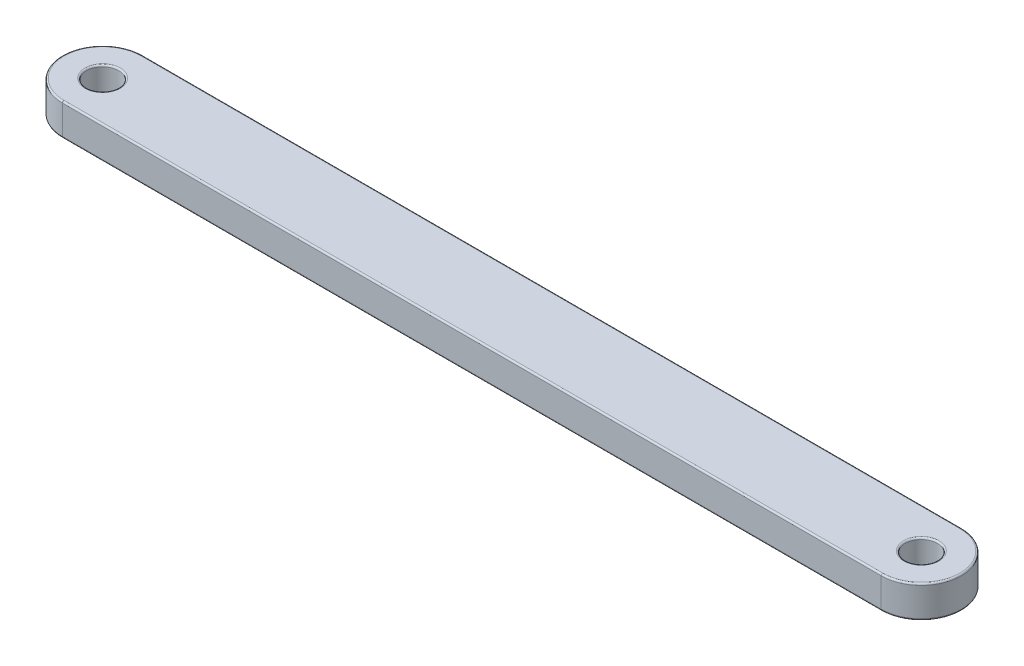
ISO-10303-21;
HEADER;
FILE_DESCRIPTION(('STEP AP214'),'2;1');
FILE_NAME('part.step','',(''),(''),'','','');
FILE_SCHEMA(('AUTOMOTIVE_DESIGN { 1 0 10303 214 1 1 1 1 }'));
ENDSEC;
DATA;
#1=APPLICATION_CONTEXT('core data for automotive mechanical design processes');
#2=APPLICATION_PROTOCOL_DEFINITION('international standard','automotive_design',2000,#1);
#3=PRODUCT_CONTEXT('',#1,'mechanical');
#4=PRODUCT('Part','Part','',(#3));
#5=PRODUCT_RELATED_PRODUCT_CATEGORY('part','',(#4));
#6=PRODUCT_DEFINITION_FORMATION('','',#4);
#7=PRODUCT_DEFINITION_CONTEXT('part definition',#1,'design');
#8=PRODUCT_DEFINITION('design','',#6,#7);
#9=PRODUCT_DEFINITION_SHAPE('','',#8);
#10=(LENGTH_UNIT() NAMED_UNIT(*) SI_UNIT(.MILLI.,.METRE.));
#11=(NAMED_UNIT(*) PLANE_ANGLE_UNIT() SI_UNIT($,.RADIAN.));
#12=(NAMED_UNIT(*) SI_UNIT($,.STERADIAN.) SOLID_ANGLE_UNIT());
#13=UNCERTAINTY_MEASURE_WITH_UNIT(LENGTH_MEASURE(1.E-05),#10,'distance_accuracy_value','');
#14=(GEOMETRIC_REPRESENTATION_CONTEXT(3) GLOBAL_UNCERTAINTY_ASSIGNED_CONTEXT((#13)) GLOBAL_UNIT_ASSIGNED_CONTEXT((#10,
#11,#12)) REPRESENTATION_CONTEXT('',''));
#15=CARTESIAN_POINT('',(0.,0.,0.));
#16=DIRECTION('',(0.,0.,1.));
#17=DIRECTION('',(1.,0.,0.));
#18=AXIS2_PLACEMENT_3D('',#15,#16,#17);
#19=CARTESIAN_POINT('',(-31.875,11.25,0.));
#20=DIRECTION('',(0.,1.,0.));
#21=DIRECTION('',(0.,0.,1.));
#22=AXIS2_PLACEMENT_3D('',#19,#20,#21);
#23=PLANE('',#22);
#24=CARTESIAN_POINT('',(31.875,11.25,0.));
#25=DIRECTION('',(0.,1.,0.));
#26=DIRECTION('',(0.,0.,1.));
#27=AXIS2_PLACEMENT_3D('',#24,#25,#26);
#28=CIRCLE('',#27,1.375);
#29=CARTESIAN_POINT('',(31.875,11.25,1.37499999999996));
#30=VERTEX_POINT('',#29);
#31=EDGE_CURVE('E11',#30,#30,#28,.F.);
#32=ORIENTED_EDGE('',*,*,#31,.T.);
#33=EDGE_LOOP('',(#32));
#34=FACE_BOUND('',#33,.T.);
#35=CARTESIAN_POINT('',(31.875,11.25,0.));
#36=DIRECTION('',(0.,1.,0.));
#37=DIRECTION('',(0.,0.,1.));
#38=AXIS2_PLACEMENT_3D('',#35,#36,#37);
#39=CIRCLE('',#38,3.);
#40=CARTESIAN_POINT('',(31.875,11.25,2.99999999999995));
#41=VERTEX_POINT('',#40);
#42=CARTESIAN_POINT('',(31.875,11.25,-3.00000000000005));
#43=VERTEX_POINT('',#42);
#44=EDGE_CURVE('E53',#41,#43,#39,.T.);
#45=ORIENTED_EDGE('',*,*,#44,.T.);
#46=DIRECTION('',(-1.,0.,0.));
#47=VECTOR('',#46,1.);
#48=CARTESIAN_POINT('',(-31.875,11.25,-3.00000000000004));
#49=LINE('',#48,#47);
#50=CARTESIAN_POINT('',(-31.875,11.25,-3.00000000000004));
#51=VERTEX_POINT('',#50);
#52=EDGE_CURVE('E45',#43,#51,#49,.T.);
#53=ORIENTED_EDGE('',*,*,#52,.T.);
#54=CARTESIAN_POINT('',(-31.875,11.25,0.));
#55=DIRECTION('',(0.,1.,0.));
#56=DIRECTION('',(0.,0.,1.));
#57=AXIS2_PLACEMENT_3D('',#54,#55,#56);
#58=CIRCLE('',#57,3.);
#59=CARTESIAN_POINT('',(-31.875,11.25,2.99999999999996));
#60=VERTEX_POINT('',#59);
#61=EDGE_CURVE('E171',#51,#60,#58,.T.);
#62=ORIENTED_EDGE('',*,*,#61,.T.);
#63=DIRECTION('',(1.,0.,0.));
#64=VECTOR('',#63,1.);
#65=CARTESIAN_POINT('',(31.875,11.25,2.99999999999995));
#66=LINE('',#65,#64);
#67=EDGE_CURVE('E58',#60,#41,#66,.T.);
#68=ORIENTED_EDGE('',*,*,#67,.T.);
#69=EDGE_LOOP('',(#45,#53,#62,#68));
#70=FACE_BOUND('',#69,.T.);
#71=CARTESIAN_POINT('',(-31.875,11.25,0.));
#72=DIRECTION('',(0.,1.,0.));
#73=DIRECTION('',(0.,0.,1.));
#74=AXIS2_PLACEMENT_3D('',#71,#72,#73);
#75=CIRCLE('',#74,1.375);
#76=CARTESIAN_POINT('',(-31.875,11.25,1.37499999999996));
#77=VERTEX_POINT('',#76);
#78=EDGE_CURVE('E168',#77,#77,#75,.F.);
#79=ORIENTED_EDGE('',*,*,#78,.T.);
#80=EDGE_LOOP('',(#79));
#81=FACE_BOUND('',#80,.T.);
#82=ADVANCED_FACE('F36',(#34,#70,#81),#23,.T.);
#83=CARTESIAN_POINT('',(-31.875,8.75,0.));
#84=DIRECTION('',(0.,1.,0.));
#85=DIRECTION('',(0.,0.,1.));
#86=AXIS2_PLACEMENT_3D('',#83,#84,#85);
#87=PLANE('',#86);
#88=CARTESIAN_POINT('',(31.875,8.75,0.));
#89=DIRECTION('',(0.,1.,0.));
#90=DIRECTION('',(0.,0.,1.));
#91=AXIS2_PLACEMENT_3D('',#88,#89,#90);
#92=CIRCLE('',#91,1.375);
#93=CARTESIAN_POINT('',(31.875,8.75,1.37499999999996));
#94=VERTEX_POINT('',#93);
#95=EDGE_CURVE('E133',#94,#94,#92,.T.);
#96=ORIENTED_EDGE('',*,*,#95,.T.);
#97=EDGE_LOOP('',(#96));
#98=FACE_BOUND('',#97,.T.);
#99=CARTESIAN_POINT('',(-31.875,8.75,0.));
#100=DIRECTION('',(0.,1.,0.));
#101=DIRECTION('',(0.,0.,1.));
#102=AXIS2_PLACEMENT_3D('',#99,#100,#101);
#103=CIRCLE('',#102,1.375);
#104=CARTESIAN_POINT('',(-31.875,8.75,1.37499999999996));
#105=VERTEX_POINT('',#104);
#106=EDGE_CURVE('E130',#105,#105,#103,.T.);
#107=ORIENTED_EDGE('',*,*,#106,.T.);
#108=EDGE_LOOP('',(#107));
#109=FACE_BOUND('',#108,.T.);
#110=CARTESIAN_POINT('',(31.875,8.75,0.));
#111=DIRECTION('',(0.,1.,0.));
#112=DIRECTION('',(0.,0.,1.));
#113=AXIS2_PLACEMENT_3D('',#110,#111,#112);
#114=CIRCLE('',#113,3.);
#115=CARTESIAN_POINT('',(31.875,8.75,-3.00000000000005));
#116=VERTEX_POINT('',#115);
#117=CARTESIAN_POINT('',(31.875,8.75,2.99999999999995));
#118=VERTEX_POINT('',#117);
#119=EDGE_CURVE('E129',#116,#118,#114,.F.);
#120=ORIENTED_EDGE('',*,*,#119,.T.);
#121=DIRECTION('',(1.,0.,0.));
#122=VECTOR('',#121,1.);
#123=CARTESIAN_POINT('',(-31.875,8.75,2.99999999999996));
#124=LINE('',#123,#122);
#125=CARTESIAN_POINT('',(-31.875,8.75,2.99999999999996));
#126=VERTEX_POINT('',#125);
#127=EDGE_CURVE('E108',#118,#126,#124,.F.);
#128=ORIENTED_EDGE('',*,*,#127,.T.);
#129=CARTESIAN_POINT('',(-31.875,8.75,0.));
#130=DIRECTION('',(0.,1.,0.));
#131=DIRECTION('',(0.,0.,1.));
#132=AXIS2_PLACEMENT_3D('',#129,#130,#131);
#133=CIRCLE('',#132,3.);
#134=CARTESIAN_POINT('',(-31.875,8.75,-3.00000000000004));
#135=VERTEX_POINT('',#134);
#136=EDGE_CURVE('E118',#126,#135,#133,.F.);
#137=ORIENTED_EDGE('',*,*,#136,.T.);
#138=DIRECTION('',(-1.,0.,0.));
#139=VECTOR('',#138,1.);
#140=CARTESIAN_POINT('',(-31.875,8.75,-3.00000000000004));
#141=LINE('',#140,#139);
#142=EDGE_CURVE('E124',#135,#116,#141,.F.);
#143=ORIENTED_EDGE('',*,*,#142,.T.);
#144=EDGE_LOOP('',(#120,#128,#137,#143));
#145=FACE_BOUND('',#144,.T.);
#146=ADVANCED_FACE('F127',(#98,#109,#145),#87,.F.);
#147=CARTESIAN_POINT('',(-31.875,11.25,0.));
#148=DIRECTION('',(0.,-1.,0.));
#149=DIRECTION('',(0.,0.,-1.));
#150=AXIS2_PLACEMENT_3D('',#147,#148,#149);
#151=CYLINDRICAL_SURFACE('',#150,3.125);
#152=DIRECTION('',(0.,-1.,0.));
#153=VECTOR('',#152,1.);
#154=CARTESIAN_POINT('',(-31.875,11.25,-3.12500000000004));
#155=LINE('',#154,#153);
#156=CARTESIAN_POINT('',(-31.875,11.125,-3.12500000000004));
#157=VERTEX_POINT('',#156);
#158=CARTESIAN_POINT('',(-31.875,8.875,-3.12500000000004));
#159=VERTEX_POINT('',#158);
#160=EDGE_CURVE('E180',#157,#159,#155,.T.);
#161=ORIENTED_EDGE('',*,*,#160,.T.);
#162=CARTESIAN_POINT('',(-31.875,8.875,0.));
#163=DIRECTION('',(0.,1.,0.));
#164=DIRECTION('',(0.,0.,1.));
#165=AXIS2_PLACEMENT_3D('',#162,#163,#164);
#166=CIRCLE('',#165,3.125);
#167=CARTESIAN_POINT('',(-31.875,8.875,3.12499999999996));
#168=VERTEX_POINT('',#167);
#169=EDGE_CURVE('E166',#159,#168,#166,.T.);
#170=ORIENTED_EDGE('',*,*,#169,.T.);
#171=DIRECTION('',(0.,-1.,0.));
#172=VECTOR('',#171,1.);
#173=CARTESIAN_POINT('',(-31.875,11.25,3.12499999999996));
#174=LINE('',#173,#172);
#175=CARTESIAN_POINT('',(-31.875,11.125,3.12499999999996));
#176=VERTEX_POINT('',#175);
#177=EDGE_CURVE('E125',#176,#168,#174,.T.);
#178=ORIENTED_EDGE('',*,*,#177,.F.);
#179=CARTESIAN_POINT('',(-31.875,11.125,0.));
#180=DIRECTION('',(0.,1.,0.));
#181=DIRECTION('',(0.,0.,1.));
#182=AXIS2_PLACEMENT_3D('',#179,#180,#181);
#183=CIRCLE('',#182,3.125);
#184=EDGE_CURVE('E164',#176,#157,#183,.F.);
#185=ORIENTED_EDGE('',*,*,#184,.T.);
#186=EDGE_LOOP('',(#161,#170,#178,#185));
#187=FACE_BOUND('',#186,.T.);
#188=ADVANCED_FACE('F206',(#187),#151,.T.);
#189=CARTESIAN_POINT('',(-31.875,11.25,3.12499999999996));
#190=DIRECTION('',(0.,0.,-1.));
#191=DIRECTION('',(-1.,0.,0.));
#192=AXIS2_PLACEMENT_3D('',#189,#190,#191);
#193=PLANE('',#192);
#194=ORIENTED_EDGE('',*,*,#177,.T.);
#195=DIRECTION('',(1.,0.,0.));
#196=VECTOR('',#195,1.);
#197=CARTESIAN_POINT('',(-31.875,8.875,3.12499999999996));
#198=LINE('',#197,#196);
#199=CARTESIAN_POINT('',(31.875,8.875,3.12499999999995));
#200=VERTEX_POINT('',#199);
#201=EDGE_CURVE('E111',#168,#200,#198,.T.);
#202=ORIENTED_EDGE('',*,*,#201,.T.);
#203=DIRECTION('',(0.,-1.,0.));
#204=VECTOR('',#203,1.);
#205=CARTESIAN_POINT('',(31.875,11.25,3.12499999999995));
#206=LINE('',#205,#204);
#207=CARTESIAN_POINT('',(31.875,11.125,3.12499999999995));
#208=VERTEX_POINT('',#207);
#209=EDGE_CURVE('E203',#208,#200,#206,.T.);
#210=ORIENTED_EDGE('',*,*,#209,.F.);
#211=DIRECTION('',(1.,0.,0.));
#212=VECTOR('',#211,1.);
#213=CARTESIAN_POINT('',(-31.875,11.125,3.12499999999996));
#214=LINE('',#213,#212);
#215=EDGE_CURVE('E152',#208,#176,#214,.F.);
#216=ORIENTED_EDGE('',*,*,#215,.T.);
#217=EDGE_LOOP('',(#194,#202,#210,#216));
#218=FACE_BOUND('',#217,.T.);
#219=ADVANCED_FACE('F201',(#218),#193,.F.);
#220=CARTESIAN_POINT('',(31.875,11.25,0.));
#221=DIRECTION('',(0.,-1.,0.));
#222=DIRECTION('',(0.,0.,-1.));
#223=AXIS2_PLACEMENT_3D('',#220,#221,#222);
#224=CYLINDRICAL_SURFACE('',#223,3.125);
#225=ORIENTED_EDGE('',*,*,#209,.T.);
#226=CARTESIAN_POINT('',(31.875,8.875,0.));
#227=DIRECTION('',(0.,1.,0.));
#228=DIRECTION('',(0.,0.,1.));
#229=AXIS2_PLACEMENT_3D('',#226,#227,#228);
#230=CIRCLE('',#229,3.125);
#231=CARTESIAN_POINT('',(31.875,8.875,-3.12500000000005));
#232=VERTEX_POINT('',#231);
#233=EDGE_CURVE('E157',#200,#232,#230,.T.);
#234=ORIENTED_EDGE('',*,*,#233,.T.);
#235=DIRECTION('',(0.,-1.,0.));
#236=VECTOR('',#235,1.);
#237=CARTESIAN_POINT('',(31.875,11.25,-3.12500000000005));
#238=LINE('',#237,#236);
#239=CARTESIAN_POINT('',(31.875,11.125,-3.12500000000005));
#240=VERTEX_POINT('',#239);
#241=EDGE_CURVE('E209',#240,#232,#238,.T.);
#242=ORIENTED_EDGE('',*,*,#241,.F.);
#243=CARTESIAN_POINT('',(31.875,11.125,0.));
#244=DIRECTION('',(0.,1.,0.));
#245=DIRECTION('',(0.,0.,1.));
#246=AXIS2_PLACEMENT_3D('',#243,#244,#245);
#247=CIRCLE('',#246,3.125);
#248=EDGE_CURVE('E155',#240,#208,#247,.F.);
#249=ORIENTED_EDGE('',*,*,#248,.T.);
#250=EDGE_LOOP('',(#225,#234,#242,#249));
#251=FACE_BOUND('',#250,.T.);
#252=ADVANCED_FACE('F222',(#251),#224,.T.);
#253=CARTESIAN_POINT('',(-31.875,11.25,-3.12500000000004));
#254=DIRECTION('',(0.,0.,1.));
#255=DIRECTION('',(1.,0.,0.));
#256=AXIS2_PLACEMENT_3D('',#253,#254,#255);
#257=PLANE('',#256);
#258=ORIENTED_EDGE('',*,*,#241,.T.);
#259=DIRECTION('',(-1.,0.,0.));
#260=VECTOR('',#259,1.);
#261=CARTESIAN_POINT('',(-31.875,8.875,-3.12500000000004));
#262=LINE('',#261,#260);
#263=EDGE_CURVE('E162',#232,#159,#262,.T.);
#264=ORIENTED_EDGE('',*,*,#263,.T.);
#265=ORIENTED_EDGE('',*,*,#160,.F.);
#266=DIRECTION('',(-1.,0.,0.));
#267=VECTOR('',#266,1.);
#268=CARTESIAN_POINT('',(31.875,11.125,-3.12500000000005));
#269=LINE('',#268,#267);
#270=EDGE_CURVE('E159',#157,#240,#269,.F.);
#271=ORIENTED_EDGE('',*,*,#270,.T.);
#272=EDGE_LOOP('',(#258,#264,#265,#271));
#273=FACE_BOUND('',#272,.T.);
#274=ADVANCED_FACE('F226',(#273),#257,.F.);
#275=CARTESIAN_POINT('',(-31.875,11.25,0.));
#276=DIRECTION('',(0.,-1.,0.));
#277=DIRECTION('',(0.,0.,-1.));
#278=AXIS2_PLACEMENT_3D('',#275,#276,#277);
#279=CYLINDRICAL_SURFACE('',#278,1.25);
#280=CARTESIAN_POINT('',(-31.875,8.875,0.));
#281=DIRECTION('',(0.,1.,0.));
#282=DIRECTION('',(0.,0.,1.));
#283=AXIS2_PLACEMENT_3D('',#280,#281,#282);
#284=CIRCLE('',#283,1.25);
#285=CARTESIAN_POINT('',(-31.875,8.875,1.24999999999996));
#286=VERTEX_POINT('',#285);
#287=EDGE_CURVE('E149',#286,#286,#284,.F.);
#288=ORIENTED_EDGE('',*,*,#287,.T.);
#289=EDGE_LOOP('',(#288));
#290=FACE_BOUND('',#289,.T.);
#291=CARTESIAN_POINT('',(-31.875,11.125,0.));
#292=DIRECTION('',(0.,1.,0.));
#293=DIRECTION('',(0.,0.,1.));
#294=AXIS2_PLACEMENT_3D('',#291,#292,#293);
#295=CIRCLE('',#294,1.25);
#296=CARTESIAN_POINT('',(-31.875,11.125,1.24999999999996));
#297=VERTEX_POINT('',#296);
#298=EDGE_CURVE('E146',#297,#297,#295,.T.);
#299=ORIENTED_EDGE('',*,*,#298,.T.);
#300=EDGE_LOOP('',(#299));
#301=FACE_BOUND('',#300,.T.);
#302=ADVANCED_FACE('F242',(#290,#301),#279,.F.);
#303=CARTESIAN_POINT('',(31.875,11.25,0.));
#304=DIRECTION('',(0.,-1.,0.));
#305=DIRECTION('',(0.,0.,-1.));
#306=AXIS2_PLACEMENT_3D('',#303,#304,#305);
#307=CYLINDRICAL_SURFACE('',#306,1.25);
#308=CARTESIAN_POINT('',(31.875,8.875,0.));
#309=DIRECTION('',(0.,1.,0.));
#310=DIRECTION('',(0.,0.,1.));
#311=AXIS2_PLACEMENT_3D('',#308,#309,#310);
#312=CIRCLE('',#311,1.25);
#313=CARTESIAN_POINT('',(31.875,8.875,1.24999999999996));
#314=VERTEX_POINT('',#313);
#315=EDGE_CURVE('E143',#314,#314,#312,.F.);
#316=ORIENTED_EDGE('',*,*,#315,.T.);
#317=EDGE_LOOP('',(#316));
#318=FACE_BOUND('',#317,.T.);
#319=CARTESIAN_POINT('',(31.875,11.125,0.));
#320=DIRECTION('',(0.,1.,0.));
#321=DIRECTION('',(0.,0.,1.));
#322=AXIS2_PLACEMENT_3D('',#319,#320,#321);
#323=CIRCLE('',#322,1.25);
#324=CARTESIAN_POINT('',(31.875,11.125,1.24999999999996));
#325=VERTEX_POINT('',#324);
#326=EDGE_CURVE('E140',#325,#325,#323,.T.);
#327=ORIENTED_EDGE('',*,*,#326,.T.);
#328=EDGE_LOOP('',(#327));
#329=FACE_BOUND('',#328,.T.);
#330=ADVANCED_FACE('F244',(#318,#329),#307,.F.);
#331=CARTESIAN_POINT('',(31.875,8.875,0.));
#332=DIRECTION('',(0.,1.,0.));
#333=DIRECTION('',(0.,0.,1.));
#334=AXIS2_PLACEMENT_3D('',#331,#332,#333);
#335=TOROIDAL_SURFACE('',#334,1.375,0.125);
#336=ORIENTED_EDGE('',*,*,#315,.F.);
#337=EDGE_LOOP('',(#336));
#338=FACE_BOUND('',#337,.T.);
#339=ORIENTED_EDGE('',*,*,#95,.F.);
#340=EDGE_LOOP('',(#339));
#341=FACE_BOUND('',#340,.T.);
#342=ADVANCED_FACE('F251',(#338,#341),#335,.T.);
#343=CARTESIAN_POINT('',(-31.875,8.875,0.));
#344=DIRECTION('',(0.,1.,0.));
#345=DIRECTION('',(0.,0.,1.));
#346=AXIS2_PLACEMENT_3D('',#343,#344,#345);
#347=TOROIDAL_SURFACE('',#346,1.375,0.125);
#348=ORIENTED_EDGE('',*,*,#287,.F.);
#349=EDGE_LOOP('',(#348));
#350=FACE_BOUND('',#349,.T.);
#351=ORIENTED_EDGE('',*,*,#106,.F.);
#352=EDGE_LOOP('',(#351));
#353=FACE_BOUND('',#352,.T.);
#354=ADVANCED_FACE('F267',(#350,#353),#347,.T.);
#355=CARTESIAN_POINT('',(-31.875,8.875,-3.00000000000004));
#356=DIRECTION('',(-1.,0.,0.));
#357=DIRECTION('',(0.,0.,1.));
#358=AXIS2_PLACEMENT_3D('',#355,#356,#357);
#359=CYLINDRICAL_SURFACE('',#358,0.125);
#360=CARTESIAN_POINT('',(31.875,8.875,-3.00000000000005));
#361=DIRECTION('',(1.,0.,0.));
#362=DIRECTION('',(0.,0.,-1.));
#363=AXIS2_PLACEMENT_3D('',#360,#361,#362);
#364=CIRCLE('',#363,0.125);
#365=EDGE_CURVE('E114',#116,#232,#364,.T.);
#366=ORIENTED_EDGE('',*,*,#365,.F.);
#367=ORIENTED_EDGE('',*,*,#142,.F.);
#368=CARTESIAN_POINT('',(-31.875,8.875,-3.00000000000004));
#369=DIRECTION('',(-1.,0.,0.));
#370=DIRECTION('',(0.,0.,1.));
#371=AXIS2_PLACEMENT_3D('',#368,#369,#370);
#372=CIRCLE('',#371,0.125);
#373=EDGE_CURVE('E121',#159,#135,#372,.T.);
#374=ORIENTED_EDGE('',*,*,#373,.F.);
#375=ORIENTED_EDGE('',*,*,#263,.F.);
#376=EDGE_LOOP('',(#366,#367,#374,#375));
#377=FACE_BOUND('',#376,.T.);
#378=ADVANCED_FACE('F215',(#377),#359,.T.);
#379=CARTESIAN_POINT('',(-31.875,8.875,0.));
#380=DIRECTION('',(0.,1.,0.));
#381=DIRECTION('',(0.,0.,1.));
#382=AXIS2_PLACEMENT_3D('',#379,#380,#381);
#383=TOROIDAL_SURFACE('',#382,3.,0.125);
#384=ORIENTED_EDGE('',*,*,#373,.T.);
#385=ORIENTED_EDGE('',*,*,#136,.F.);
#386=CARTESIAN_POINT('',(-31.875,8.875,2.99999999999996));
#387=DIRECTION('',(1.,0.,0.));
#388=DIRECTION('',(0.,0.,-1.));
#389=AXIS2_PLACEMENT_3D('',#386,#387,#388);
#390=CIRCLE('',#389,0.125);
#391=EDGE_CURVE('E104',#168,#126,#390,.T.);
#392=ORIENTED_EDGE('',*,*,#391,.F.);
#393=ORIENTED_EDGE('',*,*,#169,.F.);
#394=EDGE_LOOP('',(#384,#385,#392,#393));
#395=FACE_BOUND('',#394,.T.);
#396=ADVANCED_FACE('F119',(#395),#383,.T.);
#397=CARTESIAN_POINT('',(31.875,8.875,0.));
#398=DIRECTION('',(0.,1.,0.));
#399=DIRECTION('',(0.,0.,1.));
#400=AXIS2_PLACEMENT_3D('',#397,#398,#399);
#401=TOROIDAL_SURFACE('',#400,3.,0.125);
#402=ORIENTED_EDGE('',*,*,#365,.T.);
#403=ORIENTED_EDGE('',*,*,#233,.F.);
#404=CARTESIAN_POINT('',(31.875,8.875,2.99999999999995));
#405=DIRECTION('',(-1.,0.,0.));
#406=DIRECTION('',(0.,0.,1.));
#407=AXIS2_PLACEMENT_3D('',#404,#405,#406);
#408=CIRCLE('',#407,0.125);
#409=EDGE_CURVE('E115',#118,#200,#408,.T.);
#410=ORIENTED_EDGE('',*,*,#409,.F.);
#411=ORIENTED_EDGE('',*,*,#119,.F.);
#412=EDGE_LOOP('',(#402,#403,#410,#411));
#413=FACE_BOUND('',#412,.T.);
#414=ADVANCED_FACE('F218',(#413),#401,.T.);
#415=CARTESIAN_POINT('',(-31.875,8.875,2.99999999999996));
#416=DIRECTION('',(1.,0.,0.));
#417=DIRECTION('',(0.,0.,-1.));
#418=AXIS2_PLACEMENT_3D('',#415,#416,#417);
#419=CYLINDRICAL_SURFACE('',#418,0.125);
#420=ORIENTED_EDGE('',*,*,#391,.T.);
#421=ORIENTED_EDGE('',*,*,#127,.F.);
#422=ORIENTED_EDGE('',*,*,#409,.T.);
#423=ORIENTED_EDGE('',*,*,#201,.F.);
#424=EDGE_LOOP('',(#420,#421,#422,#423));
#425=FACE_BOUND('',#424,.T.);
#426=ADVANCED_FACE('F106',(#425),#419,.T.);
#427=CARTESIAN_POINT('',(31.875,11.125,0.));
#428=DIRECTION('',(0.,1.,0.));
#429=DIRECTION('',(0.,0.,1.));
#430=AXIS2_PLACEMENT_3D('',#427,#428,#429);
#431=TOROIDAL_SURFACE('',#430,1.375,0.125);
#432=ORIENTED_EDGE('',*,*,#31,.F.);
#433=EDGE_LOOP('',(#432));
#434=FACE_BOUND('',#433,.T.);
#435=ORIENTED_EDGE('',*,*,#326,.F.);
#436=EDGE_LOOP('',(#435));
#437=FACE_BOUND('',#436,.T.);
#438=ADVANCED_FACE('F274',(#434,#437),#431,.T.);
#439=CARTESIAN_POINT('',(-31.875,11.125,2.99999999999996));
#440=DIRECTION('',(-1.,0.,0.));
#441=DIRECTION('',(0.,0.,1.));
#442=AXIS2_PLACEMENT_3D('',#439,#440,#441);
#443=CYLINDRICAL_SURFACE('',#442,0.125);
#444=CARTESIAN_POINT('',(-31.875,11.125,2.99999999999996));
#445=DIRECTION('',(-1.,0.,0.));
#446=DIRECTION('',(0.,0.,1.));
#447=AXIS2_PLACEMENT_3D('',#444,#445,#446);
#448=CIRCLE('',#447,0.125);
#449=EDGE_CURVE('E184',#176,#60,#448,.T.);
#450=ORIENTED_EDGE('',*,*,#449,.F.);
#451=ORIENTED_EDGE('',*,*,#215,.F.);
#452=CARTESIAN_POINT('',(31.875,11.125,2.99999999999995));
#453=DIRECTION('',(1.,0.,0.));
#454=DIRECTION('',(0.,0.,-1.));
#455=AXIS2_PLACEMENT_3D('',#452,#453,#454);
#456=CIRCLE('',#455,0.125);
#457=EDGE_CURVE('E40',#41,#208,#456,.T.);
#458=ORIENTED_EDGE('',*,*,#457,.F.);
#459=ORIENTED_EDGE('',*,*,#67,.F.);
#460=EDGE_LOOP('',(#450,#451,#458,#459));
#461=FACE_BOUND('',#460,.T.);
#462=ADVANCED_FACE('F196',(#461),#443,.T.);
#463=CARTESIAN_POINT('',(31.875,11.125,0.));
#464=DIRECTION('',(0.,1.,0.));
#465=DIRECTION('',(0.,0.,1.));
#466=AXIS2_PLACEMENT_3D('',#463,#464,#465);
#467=TOROIDAL_SURFACE('',#466,3.,0.125);
#468=ORIENTED_EDGE('',*,*,#457,.T.);
#469=ORIENTED_EDGE('',*,*,#248,.F.);
#470=CARTESIAN_POINT('',(31.875,11.125,-3.00000000000005));
#471=DIRECTION('',(-1.,0.,0.));
#472=DIRECTION('',(0.,0.,1.));
#473=AXIS2_PLACEMENT_3D('',#470,#471,#472);
#474=CIRCLE('',#473,0.125);
#475=EDGE_CURVE('E183',#43,#240,#474,.T.);
#476=ORIENTED_EDGE('',*,*,#475,.F.);
#477=ORIENTED_EDGE('',*,*,#44,.F.);
#478=EDGE_LOOP('',(#468,#469,#476,#477));
#479=FACE_BOUND('',#478,.T.);
#480=ADVANCED_FACE('F193',(#479),#467,.T.);
#481=CARTESIAN_POINT('',(-31.875,11.125,0.));
#482=DIRECTION('',(0.,1.,0.));
#483=DIRECTION('',(0.,0.,1.));
#484=AXIS2_PLACEMENT_3D('',#481,#482,#483);
#485=TOROIDAL_SURFACE('',#484,3.,0.125);
#486=ORIENTED_EDGE('',*,*,#449,.T.);
#487=ORIENTED_EDGE('',*,*,#61,.F.);
#488=CARTESIAN_POINT('',(-31.875,11.125,-3.00000000000004));
#489=DIRECTION('',(1.,0.,0.));
#490=DIRECTION('',(0.,0.,-1.));
#491=AXIS2_PLACEMENT_3D('',#488,#489,#490);
#492=CIRCLE('',#491,0.125);
#493=EDGE_CURVE('E181',#157,#51,#492,.T.);
#494=ORIENTED_EDGE('',*,*,#493,.F.);
#495=ORIENTED_EDGE('',*,*,#184,.F.);
#496=EDGE_LOOP('',(#486,#487,#494,#495));
#497=FACE_BOUND('',#496,.T.);
#498=ADVANCED_FACE('F231',(#497),#485,.T.);
#499=CARTESIAN_POINT('',(-31.875,11.125,-3.00000000000004));
#500=DIRECTION('',(1.,0.,0.));
#501=DIRECTION('',(0.,0.,-1.));
#502=AXIS2_PLACEMENT_3D('',#499,#500,#501);
#503=CYLINDRICAL_SURFACE('',#502,0.125);
#504=ORIENTED_EDGE('',*,*,#475,.T.);
#505=ORIENTED_EDGE('',*,*,#270,.F.);
#506=ORIENTED_EDGE('',*,*,#493,.T.);
#507=ORIENTED_EDGE('',*,*,#52,.F.);
#508=EDGE_LOOP('',(#504,#505,#506,#507));
#509=FACE_BOUND('',#508,.T.);
#510=ADVANCED_FACE('F229',(#509),#503,.T.);
#511=CARTESIAN_POINT('',(-31.875,11.125,0.));
#512=DIRECTION('',(0.,1.,0.));
#513=DIRECTION('',(0.,0.,1.));
#514=AXIS2_PLACEMENT_3D('',#511,#512,#513);
#515=TOROIDAL_SURFACE('',#514,1.375,0.125);
#516=ORIENTED_EDGE('',*,*,#78,.F.);
#517=EDGE_LOOP('',(#516));
#518=FACE_BOUND('',#517,.T.);
#519=ORIENTED_EDGE('',*,*,#298,.F.);
#520=EDGE_LOOP('',(#519));
#521=FACE_BOUND('',#520,.T.);
#522=ADVANCED_FACE('F38',(#518,#521),#515,.T.);
#523=CLOSED_SHELL('',(#82,#146,#188,#219,#252,#274,#302,#330,#342,#354,#378,#396,#414,#426,#438,
#462,#480,#498,#510,#522));
#524=MANIFOLD_SOLID_BREP('B2',#523);
#525=ADVANCED_BREP_SHAPE_REPRESENTATION('',(#18,#524),#14);
#526=SHAPE_DEFINITION_REPRESENTATION(#9,#525);
ENDSEC;
END-ISO-10303-21;
